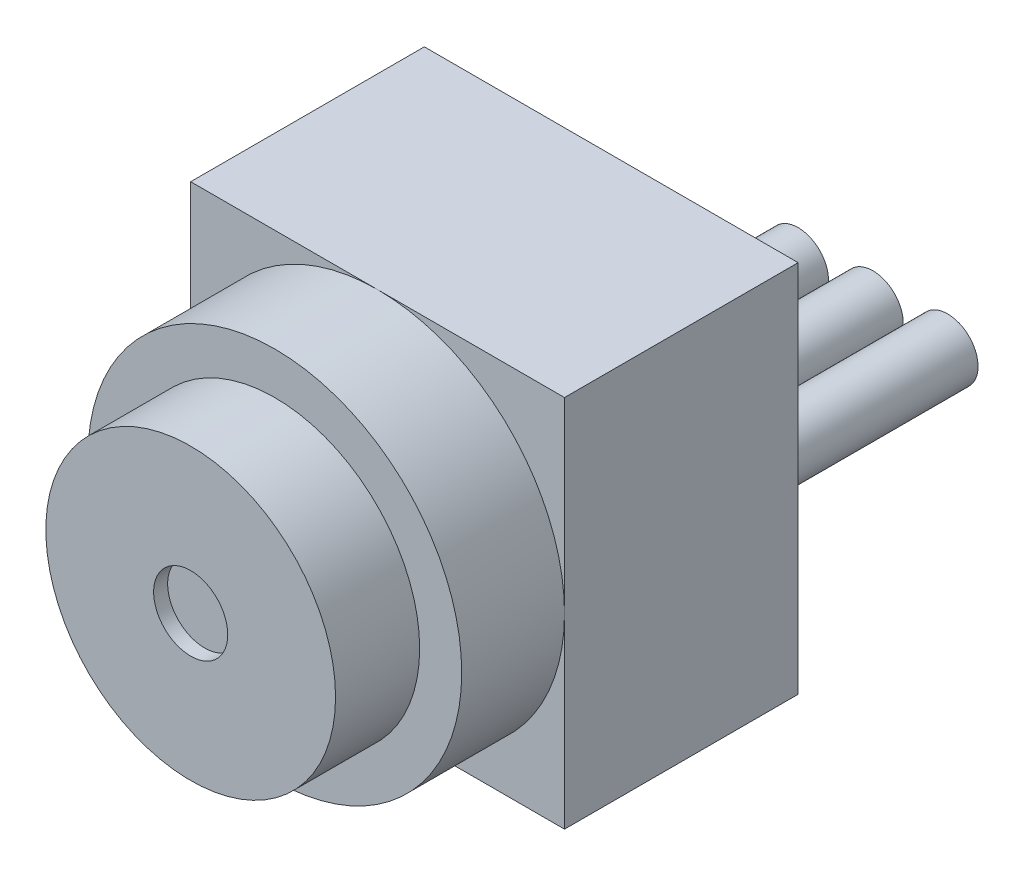
ISO-10303-21;
HEADER;
FILE_DESCRIPTION(('STEP AP214'),'2;1');
FILE_NAME('part.step','',(''),(''),'','','');
FILE_SCHEMA(('AUTOMOTIVE_DESIGN { 1 0 10303 214 1 1 1 1 }'));
ENDSEC;
DATA;
#1=APPLICATION_CONTEXT('core data for automotive mechanical design processes');
#2=APPLICATION_PROTOCOL_DEFINITION('international standard','automotive_design',2000,#1);
#3=PRODUCT_CONTEXT('',#1,'mechanical');
#4=PRODUCT('Part','Part','',(#3));
#5=PRODUCT_RELATED_PRODUCT_CATEGORY('part','',(#4));
#6=PRODUCT_DEFINITION_FORMATION('','',#4);
#7=PRODUCT_DEFINITION_CONTEXT('part definition',#1,'design');
#8=PRODUCT_DEFINITION('design','',#6,#7);
#9=PRODUCT_DEFINITION_SHAPE('','',#8);
#10=(LENGTH_UNIT() NAMED_UNIT(*) SI_UNIT(.MILLI.,.METRE.));
#11=(NAMED_UNIT(*) PLANE_ANGLE_UNIT() SI_UNIT($,.RADIAN.));
#12=(NAMED_UNIT(*) SI_UNIT($,.STERADIAN.) SOLID_ANGLE_UNIT());
#13=UNCERTAINTY_MEASURE_WITH_UNIT(LENGTH_MEASURE(1.E-05),#10,'distance_accuracy_value','');
#14=(GEOMETRIC_REPRESENTATION_CONTEXT(3) GLOBAL_UNCERTAINTY_ASSIGNED_CONTEXT((#13)) GLOBAL_UNIT_ASSIGNED_CONTEXT((#10,
#11,#12)) REPRESENTATION_CONTEXT('',''));
#15=CARTESIAN_POINT('',(0.,0.,0.));
#16=DIRECTION('',(0.,0.,1.));
#17=DIRECTION('',(1.,0.,0.));
#18=AXIS2_PLACEMENT_3D('',#15,#16,#17);
#19=CARTESIAN_POINT('',(0.,10.16,0.));
#20=DIRECTION('',(0.,0.,-1.));
#21=DIRECTION('',(-1.,0.,0.));
#22=AXIS2_PLACEMENT_3D('',#19,#20,#21);
#23=PLANE('',#22);
#24=CARTESIAN_POINT('',(7.112,5.08,0.));
#25=DIRECTION('',(0.,0.,-1.));
#26=DIRECTION('',(-1.,0.,0.));
#27=AXIS2_PLACEMENT_3D('',#24,#25,#26);
#28=CIRCLE('',#27,0.8255);
#29=CARTESIAN_POINT('',(6.2865,5.08,0.));
#30=VERTEX_POINT('',#29);
#31=EDGE_CURVE('E343',#30,#30,#28,.T.);
#32=ORIENTED_EDGE('',*,*,#31,.F.);
#33=EDGE_LOOP('',(#32));
#34=FACE_BOUND('',#33,.T.);
#35=DIRECTION('',(0.,-1.,0.));
#36=VECTOR('',#35,1.);
#37=CARTESIAN_POINT('',(0.,0.,0.));
#38=LINE('',#37,#36);
#39=CARTESIAN_POINT('',(0.,10.16,0.));
#40=VERTEX_POINT('',#39);
#41=CARTESIAN_POINT('',(0.,0.,0.));
#42=VERTEX_POINT('',#41);
#43=EDGE_CURVE('E125',#40,#42,#38,.T.);
#44=ORIENTED_EDGE('',*,*,#43,.F.);
#45=DIRECTION('',(-1.,0.,0.));
#46=VECTOR('',#45,1.);
#47=CARTESIAN_POINT('',(0.,10.16,0.));
#48=LINE('',#47,#46);
#49=CARTESIAN_POINT('',(10.16,10.16,0.));
#50=VERTEX_POINT('',#49);
#51=EDGE_CURVE('E132',#50,#40,#48,.T.);
#52=ORIENTED_EDGE('',*,*,#51,.F.);
#53=DIRECTION('',(0.,1.,0.));
#54=VECTOR('',#53,1.);
#55=CARTESIAN_POINT('',(10.16,0.,0.));
#56=LINE('',#55,#54);
#57=CARTESIAN_POINT('',(10.16,0.,0.));
#58=VERTEX_POINT('',#57);
#59=EDGE_CURVE('E130',#58,#50,#56,.T.);
#60=ORIENTED_EDGE('',*,*,#59,.F.);
#61=DIRECTION('',(1.,0.,0.));
#62=VECTOR('',#61,1.);
#63=CARTESIAN_POINT('',(0.,0.,0.));
#64=LINE('',#63,#62);
#65=EDGE_CURVE('E128',#42,#58,#64,.T.);
#66=ORIENTED_EDGE('',*,*,#65,.F.);
#67=EDGE_LOOP('',(#44,#52,#60,#66));
#68=FACE_BOUND('',#67,.T.);
#69=CARTESIAN_POINT('',(5.08,5.08,0.));
#70=DIRECTION('',(0.,0.,-1.));
#71=DIRECTION('',(-1.,0.,0.));
#72=AXIS2_PLACEMENT_3D('',#69,#70,#71);
#73=CIRCLE('',#72,0.8255);
#74=CARTESIAN_POINT('',(4.2545,5.08,0.));
#75=VERTEX_POINT('',#74);
#76=EDGE_CURVE('E337',#75,#75,#73,.T.);
#77=ORIENTED_EDGE('',*,*,#76,.F.);
#78=EDGE_LOOP('',(#77));
#79=FACE_BOUND('',#78,.T.);
#80=CARTESIAN_POINT('',(9.144,5.08,0.));
#81=DIRECTION('',(0.,0.,-1.));
#82=DIRECTION('',(-1.,0.,0.));
#83=AXIS2_PLACEMENT_3D('',#80,#81,#82);
#84=CIRCLE('',#83,0.8255);
#85=CARTESIAN_POINT('',(8.3185,5.08,0.));
#86=VERTEX_POINT('',#85);
#87=EDGE_CURVE('E349',#86,#86,#84,.T.);
#88=ORIENTED_EDGE('',*,*,#87,.F.);
#89=EDGE_LOOP('',(#88));
#90=FACE_BOUND('',#89,.T.);
#91=ADVANCED_FACE('F33',(#34,#68,#79,#90),#23,.T.);
#92=CARTESIAN_POINT('',(5.08,5.08,9.144));
#93=DIRECTION('',(0.,0.,1.));
#94=DIRECTION('',(1.,0.,0.));
#95=AXIS2_PLACEMENT_3D('',#92,#93,#94);
#96=PLANE('',#95);
#97=CARTESIAN_POINT('',(5.08,5.08,9.144));
#98=DIRECTION('',(0.,0.,1.));
#99=DIRECTION('',(1.,0.,0.));
#100=AXIS2_PLACEMENT_3D('',#97,#98,#99);
#101=CIRCLE('',#100,5.08);
#102=CARTESIAN_POINT('',(10.16,5.08,9.144));
#103=VERTEX_POINT('',#102);
#104=EDGE_CURVE('E109',#103,#103,#101,.T.);
#105=ORIENTED_EDGE('',*,*,#104,.T.);
#106=EDGE_LOOP('',(#105));
#107=FACE_BOUND('',#106,.T.);
#108=CARTESIAN_POINT('',(5.08,5.08,9.144));
#109=DIRECTION('',(0.,0.,1.));
#110=DIRECTION('',(1.,0.,0.));
#111=AXIS2_PLACEMENT_3D('',#108,#109,#110);
#112=CIRCLE('',#111,3.937);
#113=CARTESIAN_POINT('',(9.017,5.08,9.144));
#114=VERTEX_POINT('',#113);
#115=EDGE_CURVE('E325',#114,#114,#112,.T.);
#116=ORIENTED_EDGE('',*,*,#115,.F.);
#117=EDGE_LOOP('',(#116));
#118=FACE_BOUND('',#117,.T.);
#119=ADVANCED_FACE('F158',(#107,#118),#96,.T.);
#120=CARTESIAN_POINT('',(0.,10.16,6.35));
#121=DIRECTION('',(0.,0.,-1.));
#122=DIRECTION('',(-1.,0.,0.));
#123=AXIS2_PLACEMENT_3D('',#120,#121,#122);
#124=PLANE('',#123);
#125=CARTESIAN_POINT('',(5.08,5.08,6.35));
#126=DIRECTION('',(0.,0.,1.));
#127=DIRECTION('',(1.,0.,0.));
#128=AXIS2_PLACEMENT_3D('',#125,#126,#127);
#129=CIRCLE('',#128,5.08);
#130=CARTESIAN_POINT('',(10.16,5.08,6.35));
#131=VERTEX_POINT('',#130);
#132=CARTESIAN_POINT('',(5.08,10.16,6.35));
#133=VERTEX_POINT('',#132);
#134=EDGE_CURVE('E44',#131,#133,#129,.T.);
#135=ORIENTED_EDGE('',*,*,#134,.F.);
#136=DIRECTION('',(0.,1.,0.));
#137=VECTOR('',#136,1.);
#138=CARTESIAN_POINT('',(10.16,0.,6.35));
#139=LINE('',#138,#137);
#140=CARTESIAN_POINT('',(10.16,10.16,6.35));
#141=VERTEX_POINT('',#140);
#142=EDGE_CURVE('E94',#131,#141,#139,.T.);
#143=ORIENTED_EDGE('',*,*,#142,.T.);
#144=DIRECTION('',(-1.,0.,0.));
#145=VECTOR('',#144,1.);
#146=CARTESIAN_POINT('',(0.,10.16,6.35));
#147=LINE('',#146,#145);
#148=EDGE_CURVE('E107',#141,#133,#147,.T.);
#149=ORIENTED_EDGE('',*,*,#148,.T.);
#150=EDGE_LOOP('',(#135,#143,#149));
#151=FACE_BOUND('',#150,.T.);
#152=ADVANCED_FACE('F106',(#151),#124,.F.);
#153=CARTESIAN_POINT('',(0.,5.08,6.35));
#154=VERTEX_POINT('',#153);
#155=EDGE_CURVE('E11',#133,#154,#129,.T.);
#156=ORIENTED_EDGE('',*,*,#155,.F.);
#157=CARTESIAN_POINT('',(0.,10.16,6.35));
#158=VERTEX_POINT('',#157);
#159=EDGE_CURVE('E93',#133,#158,#147,.T.);
#160=ORIENTED_EDGE('',*,*,#159,.T.);
#161=DIRECTION('',(0.,-1.,0.));
#162=VECTOR('',#161,1.);
#163=CARTESIAN_POINT('',(0.,0.,6.35));
#164=LINE('',#163,#162);
#165=EDGE_CURVE('E118',#158,#154,#164,.T.);
#166=ORIENTED_EDGE('',*,*,#165,.T.);
#167=EDGE_LOOP('',(#156,#160,#166));
#168=FACE_BOUND('',#167,.T.);
#169=ADVANCED_FACE('F149',(#168),#124,.F.);
#170=CARTESIAN_POINT('',(5.08,0.,6.35));
#171=VERTEX_POINT('',#170);
#172=EDGE_CURVE('E42',#154,#171,#129,.T.);
#173=ORIENTED_EDGE('',*,*,#172,.F.);
#174=CARTESIAN_POINT('',(0.,0.,6.35));
#175=VERTEX_POINT('',#174);
#176=EDGE_CURVE('E120',#154,#175,#164,.T.);
#177=ORIENTED_EDGE('',*,*,#176,.T.);
#178=DIRECTION('',(1.,0.,0.));
#179=VECTOR('',#178,1.);
#180=CARTESIAN_POINT('',(0.,0.,6.35));
#181=LINE('',#180,#179);
#182=EDGE_CURVE('E104',#175,#171,#181,.T.);
#183=ORIENTED_EDGE('',*,*,#182,.T.);
#184=EDGE_LOOP('',(#173,#177,#183));
#185=FACE_BOUND('',#184,.T.);
#186=ADVANCED_FACE('F151',(#185),#124,.F.);
#187=EDGE_CURVE('E57',#171,#131,#129,.T.);
#188=ORIENTED_EDGE('',*,*,#187,.F.);
#189=CARTESIAN_POINT('',(10.16,0.,6.35));
#190=VERTEX_POINT('',#189);
#191=EDGE_CURVE('E89',#171,#190,#181,.T.);
#192=ORIENTED_EDGE('',*,*,#191,.T.);
#193=EDGE_CURVE('E86',#190,#131,#139,.T.);
#194=ORIENTED_EDGE('',*,*,#193,.T.);
#195=EDGE_LOOP('',(#188,#192,#194));
#196=FACE_BOUND('',#195,.T.);
#197=ADVANCED_FACE('F88',(#196),#124,.F.);
#198=CARTESIAN_POINT('',(0.,0.,6.35));
#199=DIRECTION('',(1.,0.,0.));
#200=DIRECTION('',(0.,1.,0.));
#201=AXIS2_PLACEMENT_3D('',#198,#199,#200);
#202=PLANE('',#201);
#203=ORIENTED_EDGE('',*,*,#43,.T.);
#204=DIRECTION('',(0.,0.,-1.));
#205=VECTOR('',#204,1.);
#206=CARTESIAN_POINT('',(0.,0.,6.35));
#207=LINE('',#206,#205);
#208=EDGE_CURVE('E37',#175,#42,#207,.T.);
#209=ORIENTED_EDGE('',*,*,#208,.F.);
#210=ORIENTED_EDGE('',*,*,#176,.F.);
#211=ORIENTED_EDGE('',*,*,#165,.F.);
#212=DIRECTION('',(0.,0.,-1.));
#213=VECTOR('',#212,1.);
#214=CARTESIAN_POINT('',(0.,10.16,6.35));
#215=LINE('',#214,#213);
#216=EDGE_CURVE('E124',#158,#40,#215,.T.);
#217=ORIENTED_EDGE('',*,*,#216,.T.);
#218=EDGE_LOOP('',(#203,#209,#210,#211,#217));
#219=FACE_BOUND('',#218,.T.);
#220=ADVANCED_FACE('F35',(#219),#202,.F.);
#221=CARTESIAN_POINT('',(0.,0.,6.35));
#222=DIRECTION('',(0.,1.,0.));
#223=DIRECTION('',(0.,0.,1.));
#224=AXIS2_PLACEMENT_3D('',#221,#222,#223);
#225=PLANE('',#224);
#226=ORIENTED_EDGE('',*,*,#65,.T.);
#227=DIRECTION('',(0.,0.,-1.));
#228=VECTOR('',#227,1.);
#229=CARTESIAN_POINT('',(10.16,0.,6.35));
#230=LINE('',#229,#228);
#231=EDGE_CURVE('E114',#190,#58,#230,.T.);
#232=ORIENTED_EDGE('',*,*,#231,.F.);
#233=ORIENTED_EDGE('',*,*,#191,.F.);
#234=ORIENTED_EDGE('',*,*,#182,.F.);
#235=ORIENTED_EDGE('',*,*,#208,.T.);
#236=EDGE_LOOP('',(#226,#232,#233,#234,#235));
#237=FACE_BOUND('',#236,.T.);
#238=ADVANCED_FACE('F173',(#237),#225,.F.);
#239=CARTESIAN_POINT('',(10.16,0.,6.35));
#240=DIRECTION('',(-1.,0.,0.));
#241=DIRECTION('',(0.,0.,1.));
#242=AXIS2_PLACEMENT_3D('',#239,#240,#241);
#243=PLANE('',#242);
#244=ORIENTED_EDGE('',*,*,#59,.T.);
#245=DIRECTION('',(0.,0.,-1.));
#246=VECTOR('',#245,1.);
#247=CARTESIAN_POINT('',(10.16,10.16,6.35));
#248=LINE('',#247,#246);
#249=EDGE_CURVE('E100',#141,#50,#248,.T.);
#250=ORIENTED_EDGE('',*,*,#249,.F.);
#251=ORIENTED_EDGE('',*,*,#142,.F.);
#252=ORIENTED_EDGE('',*,*,#193,.F.);
#253=ORIENTED_EDGE('',*,*,#231,.T.);
#254=EDGE_LOOP('',(#244,#250,#251,#252,#253));
#255=FACE_BOUND('',#254,.T.);
#256=ADVANCED_FACE('F98',(#255),#243,.F.);
#257=CARTESIAN_POINT('',(0.,10.16,6.35));
#258=DIRECTION('',(0.,-1.,0.));
#259=DIRECTION('',(0.,0.,-1.));
#260=AXIS2_PLACEMENT_3D('',#257,#258,#259);
#261=PLANE('',#260);
#262=ORIENTED_EDGE('',*,*,#51,.T.);
#263=ORIENTED_EDGE('',*,*,#216,.F.);
#264=ORIENTED_EDGE('',*,*,#159,.F.);
#265=ORIENTED_EDGE('',*,*,#148,.F.);
#266=ORIENTED_EDGE('',*,*,#249,.T.);
#267=EDGE_LOOP('',(#262,#263,#264,#265,#266));
#268=FACE_BOUND('',#267,.T.);
#269=ADVANCED_FACE('F144',(#268),#261,.F.);
#270=CARTESIAN_POINT('',(5.08,5.08,9.144));
#271=DIRECTION('',(0.,0.,-1.));
#272=DIRECTION('',(-1.,0.,0.));
#273=AXIS2_PLACEMENT_3D('',#270,#271,#272);
#274=CYLINDRICAL_SURFACE('',#273,5.08);
#275=ORIENTED_EDGE('',*,*,#104,.F.);
#276=EDGE_LOOP('',(#275));
#277=FACE_BOUND('',#276,.T.);
#278=ORIENTED_EDGE('',*,*,#134,.T.);
#279=ORIENTED_EDGE('',*,*,#155,.T.);
#280=ORIENTED_EDGE('',*,*,#172,.T.);
#281=ORIENTED_EDGE('',*,*,#187,.T.);
#282=EDGE_LOOP('',(#278,#279,#280,#281));
#283=FACE_BOUND('',#282,.T.);
#284=ADVANCED_FACE('F112',(#277,#283),#274,.T.);
#285=CARTESIAN_POINT('',(5.08,5.08,11.43));
#286=DIRECTION('',(0.,0.,-1.));
#287=DIRECTION('',(-1.,0.,0.));
#288=AXIS2_PLACEMENT_3D('',#285,#286,#287);
#289=CYLINDRICAL_SURFACE('',#288,3.937);
#290=CARTESIAN_POINT('',(5.08,5.08,11.43));
#291=DIRECTION('',(0.,0.,1.));
#292=DIRECTION('',(1.,0.,0.));
#293=AXIS2_PLACEMENT_3D('',#290,#291,#292);
#294=CIRCLE('',#293,3.937);
#295=CARTESIAN_POINT('',(9.017,5.08,11.43));
#296=VERTEX_POINT('',#295);
#297=EDGE_CURVE('E110',#296,#296,#294,.T.);
#298=ORIENTED_EDGE('',*,*,#297,.F.);
#299=EDGE_LOOP('',(#298));
#300=FACE_BOUND('',#299,.T.);
#301=ORIENTED_EDGE('',*,*,#115,.T.);
#302=EDGE_LOOP('',(#301));
#303=FACE_BOUND('',#302,.T.);
#304=ADVANCED_FACE('F215',(#300,#303),#289,.T.);
#305=CARTESIAN_POINT('',(5.08,5.08,11.43));
#306=DIRECTION('',(0.,0.,1.));
#307=DIRECTION('',(1.,0.,0.));
#308=AXIS2_PLACEMENT_3D('',#305,#306,#307);
#309=PLANE('',#308);
#310=CARTESIAN_POINT('',(5.08,5.08,11.43));
#311=DIRECTION('',(0.,0.,1.));
#312=DIRECTION('',(1.,0.,0.));
#313=AXIS2_PLACEMENT_3D('',#310,#311,#312);
#314=CIRCLE('',#313,1.00710388883789);
#315=CARTESIAN_POINT('',(6.08710388883789,5.08,11.43));
#316=VERTEX_POINT('',#315);
#317=EDGE_CURVE('E331',#316,#316,#314,.T.);
#318=ORIENTED_EDGE('',*,*,#317,.F.);
#319=EDGE_LOOP('',(#318));
#320=FACE_BOUND('',#319,.T.);
#321=ORIENTED_EDGE('',*,*,#297,.T.);
#322=EDGE_LOOP('',(#321));
#323=FACE_BOUND('',#322,.T.);
#324=ADVANCED_FACE('F219',(#320,#323),#309,.T.);
#325=CARTESIAN_POINT('',(5.08,5.08,11.049));
#326=DIRECTION('',(0.,0.,1.));
#327=DIRECTION('',(1.,0.,0.));
#328=AXIS2_PLACEMENT_3D('',#325,#326,#327);
#329=CYLINDRICAL_SURFACE('',#328,1.00710388883789);
#330=CARTESIAN_POINT('',(5.08,5.08,11.049));
#331=DIRECTION('',(0.,0.,1.));
#332=DIRECTION('',(1.,0.,0.));
#333=AXIS2_PLACEMENT_3D('',#330,#331,#332);
#334=CIRCLE('',#333,1.00710388883789);
#335=CARTESIAN_POINT('',(6.08710388883789,5.08,11.049));
#336=VERTEX_POINT('',#335);
#337=EDGE_CURVE('E327',#336,#336,#334,.T.);
#338=ORIENTED_EDGE('',*,*,#337,.F.);
#339=EDGE_LOOP('',(#338));
#340=FACE_BOUND('',#339,.T.);
#341=ORIENTED_EDGE('',*,*,#317,.T.);
#342=EDGE_LOOP('',(#341));
#343=FACE_BOUND('',#342,.T.);
#344=ADVANCED_FACE('F229',(#340,#343),#329,.F.);
#345=CARTESIAN_POINT('',(5.08,5.08,11.049));
#346=DIRECTION('',(0.,0.,1.));
#347=DIRECTION('',(1.,0.,0.));
#348=AXIS2_PLACEMENT_3D('',#345,#346,#347);
#349=PLANE('',#348);
#350=ORIENTED_EDGE('',*,*,#337,.T.);
#351=EDGE_LOOP('',(#350));
#352=FACE_BOUND('',#351,.T.);
#353=ADVANCED_FACE('F239',(#352),#349,.T.);
#354=CARTESIAN_POINT('',(5.08,5.08,-5.08));
#355=DIRECTION('',(0.,0.,1.));
#356=DIRECTION('',(1.,0.,0.));
#357=AXIS2_PLACEMENT_3D('',#354,#355,#356);
#358=CYLINDRICAL_SURFACE('',#357,0.8255);
#359=CARTESIAN_POINT('',(5.08,5.08,-5.08));
#360=DIRECTION('',(0.,0.,-1.));
#361=DIRECTION('',(-1.,0.,0.));
#362=AXIS2_PLACEMENT_3D('',#359,#360,#361);
#363=CIRCLE('',#362,0.8255);
#364=CARTESIAN_POINT('',(4.2545,5.08,-5.08));
#365=VERTEX_POINT('',#364);
#366=EDGE_CURVE('E335',#365,#365,#363,.T.);
#367=ORIENTED_EDGE('',*,*,#366,.F.);
#368=EDGE_LOOP('',(#367));
#369=FACE_BOUND('',#368,.T.);
#370=ORIENTED_EDGE('',*,*,#76,.T.);
#371=EDGE_LOOP('',(#370));
#372=FACE_BOUND('',#371,.T.);
#373=ADVANCED_FACE('F248',(#369,#372),#358,.T.);
#374=CARTESIAN_POINT('',(5.08,5.08,-5.08));
#375=DIRECTION('',(0.,0.,-1.));
#376=DIRECTION('',(-1.,0.,0.));
#377=AXIS2_PLACEMENT_3D('',#374,#375,#376);
#378=PLANE('',#377);
#379=ORIENTED_EDGE('',*,*,#366,.T.);
#380=EDGE_LOOP('',(#379));
#381=FACE_BOUND('',#380,.T.);
#382=ADVANCED_FACE('F263',(#381),#378,.T.);
#383=CARTESIAN_POINT('',(7.112,5.08,-5.08));
#384=DIRECTION('',(0.,0.,1.));
#385=DIRECTION('',(1.,0.,0.));
#386=AXIS2_PLACEMENT_3D('',#383,#384,#385);
#387=CYLINDRICAL_SURFACE('',#386,0.8255);
#388=CARTESIAN_POINT('',(7.112,5.08,-5.08));
#389=DIRECTION('',(0.,0.,-1.));
#390=DIRECTION('',(-1.,0.,0.));
#391=AXIS2_PLACEMENT_3D('',#388,#389,#390);
#392=CIRCLE('',#391,0.8255);
#393=CARTESIAN_POINT('',(6.2865,5.08,-5.08));
#394=VERTEX_POINT('',#393);
#395=EDGE_CURVE('E340',#394,#394,#392,.T.);
#396=ORIENTED_EDGE('',*,*,#395,.F.);
#397=EDGE_LOOP('',(#396));
#398=FACE_BOUND('',#397,.T.);
#399=ORIENTED_EDGE('',*,*,#31,.T.);
#400=EDGE_LOOP('',(#399));
#401=FACE_BOUND('',#400,.T.);
#402=ADVANCED_FACE('F273',(#398,#401),#387,.T.);
#403=CARTESIAN_POINT('',(7.112,5.08,-5.08));
#404=DIRECTION('',(0.,0.,-1.));
#405=DIRECTION('',(-1.,0.,0.));
#406=AXIS2_PLACEMENT_3D('',#403,#404,#405);
#407=PLANE('',#406);
#408=ORIENTED_EDGE('',*,*,#395,.T.);
#409=EDGE_LOOP('',(#408));
#410=FACE_BOUND('',#409,.T.);
#411=ADVANCED_FACE('F283',(#410),#407,.T.);
#412=CARTESIAN_POINT('',(9.144,5.08,-5.08));
#413=DIRECTION('',(0.,0.,1.));
#414=DIRECTION('',(1.,0.,0.));
#415=AXIS2_PLACEMENT_3D('',#412,#413,#414);
#416=CYLINDRICAL_SURFACE('',#415,0.8255);
#417=CARTESIAN_POINT('',(9.144,5.08,-5.08));
#418=DIRECTION('',(0.,0.,-1.));
#419=DIRECTION('',(-1.,0.,0.));
#420=AXIS2_PLACEMENT_3D('',#417,#418,#419);
#421=CIRCLE('',#420,0.8255);
#422=CARTESIAN_POINT('',(8.3185,5.08,-5.08));
#423=VERTEX_POINT('',#422);
#424=EDGE_CURVE('E346',#423,#423,#421,.T.);
#425=ORIENTED_EDGE('',*,*,#424,.F.);
#426=EDGE_LOOP('',(#425));
#427=FACE_BOUND('',#426,.T.);
#428=ORIENTED_EDGE('',*,*,#87,.T.);
#429=EDGE_LOOP('',(#428));
#430=FACE_BOUND('',#429,.T.);
#431=ADVANCED_FACE('F293',(#427,#430),#416,.T.);
#432=CARTESIAN_POINT('',(9.144,5.08,-5.08));
#433=DIRECTION('',(0.,0.,-1.));
#434=DIRECTION('',(-1.,0.,0.));
#435=AXIS2_PLACEMENT_3D('',#432,#433,#434);
#436=PLANE('',#435);
#437=ORIENTED_EDGE('',*,*,#424,.T.);
#438=EDGE_LOOP('',(#437));
#439=FACE_BOUND('',#438,.T.);
#440=ADVANCED_FACE('F303',(#439),#436,.T.);
#441=CLOSED_SHELL('',(#91,#119,#152,#169,#186,#197,#220,#238,#256,#269,#284,#304,#324,#344,#353,
#373,#382,#402,#411,#431,#440));
#442=MANIFOLD_SOLID_BREP('B2',#441);
#443=ADVANCED_BREP_SHAPE_REPRESENTATION('',(#18,#442),#14);
#444=SHAPE_DEFINITION_REPRESENTATION(#9,#443);
ENDSEC;
END-ISO-10303-21;
